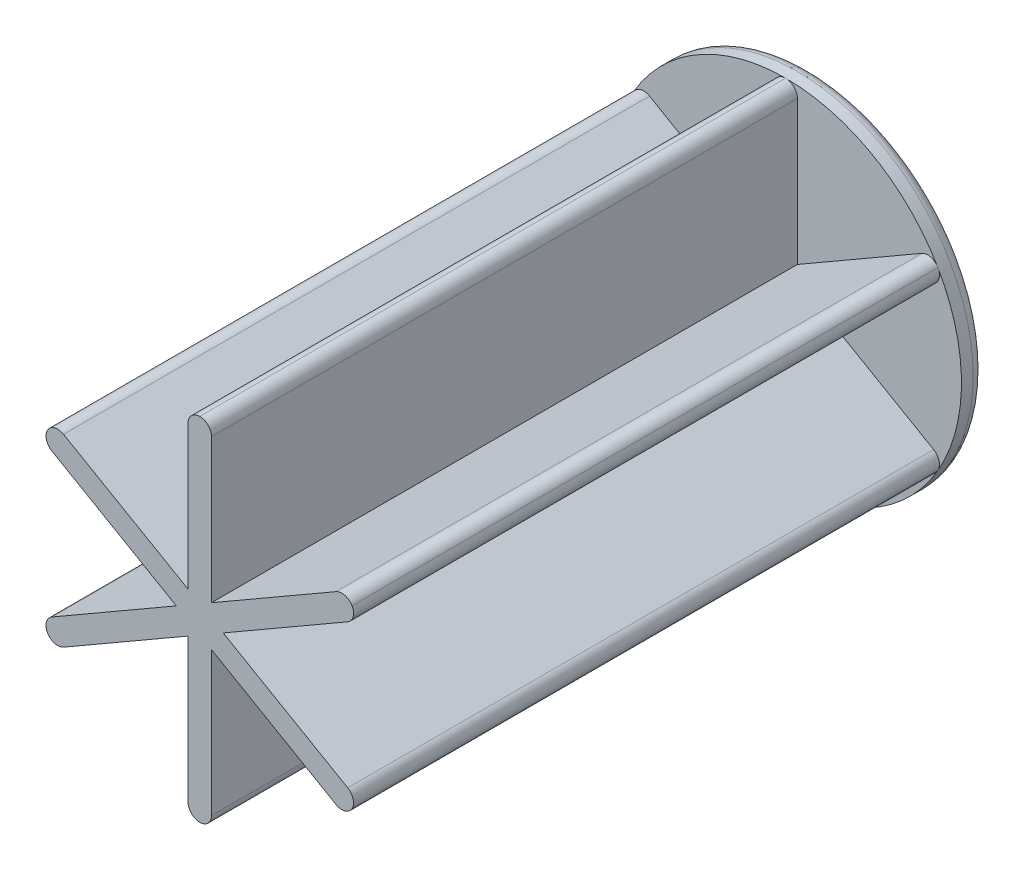
ISO-10303-21;
HEADER;
FILE_DESCRIPTION(('STEP AP214'),'2;1');
FILE_NAME('part.step','',(''),(''),'','','');
FILE_SCHEMA(('AUTOMOTIVE_DESIGN { 1 0 10303 214 1 1 1 1 }'));
ENDSEC;
DATA;
#1=APPLICATION_CONTEXT('core data for automotive mechanical design processes');
#2=APPLICATION_PROTOCOL_DEFINITION('international standard','automotive_design',2000,#1);
#3=PRODUCT_CONTEXT('',#1,'mechanical');
#4=PRODUCT('Part','Part','',(#3));
#5=PRODUCT_RELATED_PRODUCT_CATEGORY('part','',(#4));
#6=PRODUCT_DEFINITION_FORMATION('','',#4);
#7=PRODUCT_DEFINITION_CONTEXT('part definition',#1,'design');
#8=PRODUCT_DEFINITION('design','',#6,#7);
#9=PRODUCT_DEFINITION_SHAPE('','',#8);
#10=(LENGTH_UNIT() NAMED_UNIT(*) SI_UNIT(.MILLI.,.METRE.));
#11=(NAMED_UNIT(*) PLANE_ANGLE_UNIT() SI_UNIT($,.RADIAN.));
#12=(NAMED_UNIT(*) SI_UNIT($,.STERADIAN.) SOLID_ANGLE_UNIT());
#13=UNCERTAINTY_MEASURE_WITH_UNIT(LENGTH_MEASURE(1.E-05),#10,'distance_accuracy_value','');
#14=(GEOMETRIC_REPRESENTATION_CONTEXT(3) GLOBAL_UNCERTAINTY_ASSIGNED_CONTEXT((#13)) GLOBAL_UNIT_ASSIGNED_CONTEXT((#10,
#11,#12)) REPRESENTATION_CONTEXT('',''));
#15=CARTESIAN_POINT('',(0.,0.,0.));
#16=DIRECTION('',(0.,0.,1.));
#17=DIRECTION('',(1.,0.,0.));
#18=AXIS2_PLACEMENT_3D('',#15,#16,#17);
#19=CARTESIAN_POINT('',(0.,0.,2.));
#20=DIRECTION('',(0.,0.,1.));
#21=DIRECTION('',(1.,0.,0.));
#22=AXIS2_PLACEMENT_3D('',#19,#20,#21);
#23=PLANE('',#22);
#24=CARTESIAN_POINT('',(0.,0.,2.));
#25=DIRECTION('',(0.,0.,1.));
#26=DIRECTION('',(1.,0.,0.));
#27=AXIS2_PLACEMENT_3D('',#24,#25,#26);
#28=CIRCLE('',#27,3.);
#29=CARTESIAN_POINT('',(1.,-2.82842712474619,2.));
#30=VERTEX_POINT('',#29);
#31=CARTESIAN_POINT('',(1.94948974278318,-2.28023896615753,2.));
#32=VERTEX_POINT('',#31);
#33=EDGE_CURVE('E331',#30,#32,#28,.T.);
#34=ORIENTED_EDGE('',*,*,#33,.F.);
#35=DIRECTION('',(0.,1.,0.));
#36=VECTOR('',#35,1.);
#37=CARTESIAN_POINT('',(1.,-14.9666295470958,2.));
#38=LINE('',#37,#36);
#39=CARTESIAN_POINT('',(1.,-14.,2.));
#40=VERTEX_POINT('',#39);
#41=EDGE_CURVE('E389',#40,#30,#38,.T.);
#42=ORIENTED_EDGE('',*,*,#41,.F.);
#43=CARTESIAN_POINT('',(0.,-14.,2.));
#44=DIRECTION('',(0.,0.,1.));
#45=DIRECTION('',(1.,0.,0.));
#46=AXIS2_PLACEMENT_3D('',#43,#44,#45);
#47=CIRCLE('',#46,1.);
#48=CARTESIAN_POINT('',(0.,-15.,2.));
#49=VERTEX_POINT('',#48);
#50=EDGE_CURVE('E457',#40,#49,#47,.F.);
#51=ORIENTED_EDGE('',*,*,#50,.T.);
#52=CARTESIAN_POINT('',(0.,0.,2.));
#53=DIRECTION('',(0.,0.,1.));
#54=DIRECTION('',(1.,0.,0.));
#55=AXIS2_PLACEMENT_3D('',#52,#53,#54);
#56=CIRCLE('',#55,15.);
#57=CARTESIAN_POINT('',(12.9903810567666,-7.49999999999997,2.));
#58=VERTEX_POINT('',#57);
#59=EDGE_CURVE('E391',#49,#58,#56,.T.);
#60=ORIENTED_EDGE('',*,*,#59,.T.);
#61=CARTESIAN_POINT('',(12.1243556529822,-6.99999999999997,2.));
#62=DIRECTION('',(0.,0.,1.));
#63=DIRECTION('',(1.,0.,0.));
#64=AXIS2_PLACEMENT_3D('',#61,#62,#63);
#65=CIRCLE('',#64,1.);
#66=CARTESIAN_POINT('',(11.6243556529822,-7.86602540378441,2.));
#67=VERTEX_POINT('',#66);
#68=EDGE_CURVE('E460',#58,#67,#65,.F.);
#69=ORIENTED_EDGE('',*,*,#68,.T.);
#70=DIRECTION('',(0.86602540378444,-0.499999999999998,0.));
#71=VECTOR('',#70,1.);
#72=CARTESIAN_POINT('',(12.4614813968157,-8.34934017733229,2.));
#73=LINE('',#72,#71);
#74=EDGE_CURVE('E354',#32,#67,#73,.T.);
#75=ORIENTED_EDGE('',*,*,#74,.F.);
#76=EDGE_LOOP('',(#34,#42,#51,#60,#69,#75));
#77=FACE_BOUND('',#76,.T.);
#78=ADVANCED_FACE('F37',(#77),#23,.T.);
#79=CARTESIAN_POINT('',(1.,1.73205080756888,2.));
#80=VERTEX_POINT('',#79);
#81=CARTESIAN_POINT('',(1.,14.,2.));
#82=VERTEX_POINT('',#81);
#83=EDGE_CURVE('E388',#80,#82,#38,.T.);
#84=ORIENTED_EDGE('',*,*,#83,.F.);
#85=DIRECTION('',(-0.866025403784436,-0.500000000000004,0.));
#86=VECTOR('',#85,1.);
#87=CARTESIAN_POINT('',(12.4614813968157,8.34934017733238,2.));
#88=LINE('',#87,#86);
#89=CARTESIAN_POINT('',(11.6243556529821,7.86602540378449,2.));
#90=VERTEX_POINT('',#89);
#91=EDGE_CURVE('E347',#90,#80,#88,.T.);
#92=ORIENTED_EDGE('',*,*,#91,.F.);
#93=CARTESIAN_POINT('',(12.1243556529821,7.00000000000006,2.));
#94=DIRECTION('',(0.,0.,1.));
#95=DIRECTION('',(1.,0.,0.));
#96=AXIS2_PLACEMENT_3D('',#93,#94,#95);
#97=CIRCLE('',#96,1.);
#98=CARTESIAN_POINT('',(12.9903810567665,7.50000000000006,2.));
#99=VERTEX_POINT('',#98);
#100=EDGE_CURVE('E467',#90,#99,#97,.F.);
#101=ORIENTED_EDGE('',*,*,#100,.T.);
#102=CARTESIAN_POINT('',(0.,15.,2.));
#103=VERTEX_POINT('',#102);
#104=EDGE_CURVE('E385',#99,#103,#56,.T.);
#105=ORIENTED_EDGE('',*,*,#104,.T.);
#106=CARTESIAN_POINT('',(0.,14.,2.));
#107=DIRECTION('',(0.,0.,1.));
#108=DIRECTION('',(1.,0.,0.));
#109=AXIS2_PLACEMENT_3D('',#106,#107,#108);
#110=CIRCLE('',#109,1.);
#111=EDGE_CURVE('E470',#103,#82,#110,.F.);
#112=ORIENTED_EDGE('',*,*,#111,.T.);
#113=EDGE_LOOP('',(#84,#92,#101,#105,#112));
#114=FACE_BOUND('',#113,.T.);
#115=ADVANCED_FACE('F513',(#114),#23,.T.);
#116=CARTESIAN_POINT('',(0.,0.,2.));
#117=DIRECTION('',(0.,0.,1.));
#118=DIRECTION('',(1.,0.,0.));
#119=AXIS2_PLACEMENT_3D('',#116,#117,#118);
#120=CIRCLE('',#119,3.);
#121=CARTESIAN_POINT('',(2.94948974278318,-0.54818815858865,2.));
#122=VERTEX_POINT('',#121);
#123=CARTESIAN_POINT('',(2.94948974278318,0.548188158588671,2.));
#124=VERTEX_POINT('',#123);
#125=EDGE_CURVE('E323',#122,#124,#120,.T.);
#126=ORIENTED_EDGE('',*,*,#125,.F.);
#127=DIRECTION('',(-0.86602540378444,0.499999999999998,0.));
#128=VECTOR('',#127,1.);
#129=CARTESIAN_POINT('',(13.4614813968157,-6.61728936976341,2.));
#130=LINE('',#129,#128);
#131=CARTESIAN_POINT('',(12.6243556529822,-6.13397459621553,2.));
#132=VERTEX_POINT('',#131);
#133=EDGE_CURVE('E365',#132,#122,#130,.T.);
#134=ORIENTED_EDGE('',*,*,#133,.F.);
#135=CARTESIAN_POINT('',(12.1243556529822,-6.99999999999997,2.));
#136=DIRECTION('',(0.,0.,1.));
#137=DIRECTION('',(1.,0.,0.));
#138=AXIS2_PLACEMENT_3D('',#135,#136,#137);
#139=CIRCLE('',#138,1.);
#140=EDGE_CURVE('E462',#132,#58,#139,.F.);
#141=ORIENTED_EDGE('',*,*,#140,.T.);
#142=EDGE_CURVE('E395',#58,#99,#56,.T.);
#143=ORIENTED_EDGE('',*,*,#142,.T.);
#144=CARTESIAN_POINT('',(12.1243556529821,7.00000000000006,2.));
#145=DIRECTION('',(0.,0.,1.));
#146=DIRECTION('',(1.,0.,0.));
#147=AXIS2_PLACEMENT_3D('',#144,#145,#146);
#148=CIRCLE('',#147,1.);
#149=CARTESIAN_POINT('',(12.6243556529821,6.13397459621562,2.));
#150=VERTEX_POINT('',#149);
#151=EDGE_CURVE('E465',#99,#150,#148,.F.);
#152=ORIENTED_EDGE('',*,*,#151,.T.);
#153=DIRECTION('',(0.866025403784436,0.500000000000004,0.));
#154=VECTOR('',#153,1.);
#155=CARTESIAN_POINT('',(13.4614813968157,6.61728936976351,2.));
#156=LINE('',#155,#154);
#157=EDGE_CURVE('E336',#124,#150,#156,.T.);
#158=ORIENTED_EDGE('',*,*,#157,.F.);
#159=EDGE_LOOP('',(#126,#134,#141,#143,#152,#158));
#160=FACE_BOUND('',#159,.T.);
#161=ADVANCED_FACE('F520',(#160),#23,.T.);
#162=CARTESIAN_POINT('',(-12.9903810567666,7.49999999999997,2.));
#163=VERTEX_POINT('',#162);
#164=EDGE_CURVE('E396',#103,#163,#56,.T.);
#165=ORIENTED_EDGE('',*,*,#164,.T.);
#166=CARTESIAN_POINT('',(-12.1243556529822,6.99999999999997,2.));
#167=DIRECTION('',(0.,0.,1.));
#168=DIRECTION('',(1.,0.,0.));
#169=AXIS2_PLACEMENT_3D('',#166,#167,#168);
#170=CIRCLE('',#169,1.);
#171=CARTESIAN_POINT('',(-11.6243556529821,7.86602540378441,2.));
#172=VERTEX_POINT('',#171);
#173=EDGE_CURVE('E475',#163,#172,#170,.F.);
#174=ORIENTED_EDGE('',*,*,#173,.T.);
#175=CARTESIAN_POINT('',(-1.,1.73205080756886,2.));
#176=VERTEX_POINT('',#175);
#177=EDGE_CURVE('E364',#176,#172,#130,.T.);
#178=ORIENTED_EDGE('',*,*,#177,.F.);
#179=DIRECTION('',(0.,-1.,0.));
#180=VECTOR('',#179,1.);
#181=CARTESIAN_POINT('',(-1.,-14.9666295470958,2.));
#182=LINE('',#181,#180);
#183=CARTESIAN_POINT('',(-1.,14.,2.));
#184=VERTEX_POINT('',#183);
#185=EDGE_CURVE('E386',#184,#176,#182,.T.);
#186=ORIENTED_EDGE('',*,*,#185,.F.);
#187=CARTESIAN_POINT('',(0.,14.,2.));
#188=DIRECTION('',(0.,0.,1.));
#189=DIRECTION('',(1.,0.,0.));
#190=AXIS2_PLACEMENT_3D('',#187,#188,#189);
#191=CIRCLE('',#190,1.);
#192=EDGE_CURVE('E472',#184,#103,#191,.F.);
#193=ORIENTED_EDGE('',*,*,#192,.T.);
#194=EDGE_LOOP('',(#165,#174,#178,#186,#193));
#195=FACE_BOUND('',#194,.T.);
#196=ADVANCED_FACE('F534',(#195),#23,.T.);
#197=CARTESIAN_POINT('',(0.,0.,2.));
#198=DIRECTION('',(0.,0.,1.));
#199=DIRECTION('',(1.,0.,0.));
#200=AXIS2_PLACEMENT_3D('',#197,#198,#199);
#201=CIRCLE('',#200,3.);
#202=CARTESIAN_POINT('',(-1.94948974278317,-2.28023896615754,2.));
#203=VERTEX_POINT('',#202);
#204=CARTESIAN_POINT('',(-1.,-2.82842712474619,2.));
#205=VERTEX_POINT('',#204);
#206=EDGE_CURVE('E315',#203,#205,#201,.T.);
#207=ORIENTED_EDGE('',*,*,#206,.F.);
#208=CARTESIAN_POINT('',(-11.6243556529821,-7.86602540378449,2.));
#209=VERTEX_POINT('',#208);
#210=EDGE_CURVE('E344',#209,#203,#156,.T.);
#211=ORIENTED_EDGE('',*,*,#210,.F.);
#212=CARTESIAN_POINT('',(-12.1243556529821,-7.00000000000006,2.));
#213=DIRECTION('',(0.,0.,1.));
#214=DIRECTION('',(1.,0.,0.));
#215=AXIS2_PLACEMENT_3D('',#212,#213,#214);
#216=CIRCLE('',#215,1.);
#217=CARTESIAN_POINT('',(-12.9903810567665,-7.50000000000006,2.));
#218=VERTEX_POINT('',#217);
#219=EDGE_CURVE('E60',#209,#218,#216,.F.);
#220=ORIENTED_EDGE('',*,*,#219,.T.);
#221=EDGE_CURVE('E394',#218,#49,#56,.T.);
#222=ORIENTED_EDGE('',*,*,#221,.T.);
#223=CARTESIAN_POINT('',(0.,-14.,2.));
#224=DIRECTION('',(0.,0.,1.));
#225=DIRECTION('',(1.,0.,0.));
#226=AXIS2_PLACEMENT_3D('',#223,#224,#225);
#227=CIRCLE('',#226,1.);
#228=CARTESIAN_POINT('',(-1.,-14.,2.));
#229=VERTEX_POINT('',#228);
#230=EDGE_CURVE('E455',#49,#229,#227,.F.);
#231=ORIENTED_EDGE('',*,*,#230,.T.);
#232=EDGE_CURVE('E378',#205,#229,#182,.T.);
#233=ORIENTED_EDGE('',*,*,#232,.F.);
#234=EDGE_LOOP('',(#207,#211,#220,#222,#231,#233));
#235=FACE_BOUND('',#234,.T.);
#236=ADVANCED_FACE('F527',(#235),#23,.T.);
#237=CARTESIAN_POINT('',(0.,0.,2.));
#238=DIRECTION('',(0.,0.,1.));
#239=DIRECTION('',(1.,0.,0.));
#240=AXIS2_PLACEMENT_3D('',#237,#238,#239);
#241=CIRCLE('',#240,3.);
#242=CARTESIAN_POINT('',(-2.94948974278318,0.548188158588649,2.));
#243=VERTEX_POINT('',#242);
#244=CARTESIAN_POINT('',(-2.94948974278318,-0.548188158588668,2.));
#245=VERTEX_POINT('',#244);
#246=EDGE_CURVE('E308',#243,#245,#241,.T.);
#247=ORIENTED_EDGE('',*,*,#246,.F.);
#248=CARTESIAN_POINT('',(-12.6243556529821,6.13397459621553,2.));
#249=VERTEX_POINT('',#248);
#250=EDGE_CURVE('E362',#249,#243,#73,.T.);
#251=ORIENTED_EDGE('',*,*,#250,.F.);
#252=CARTESIAN_POINT('',(-12.1243556529822,6.99999999999997,2.));
#253=DIRECTION('',(0.,0.,1.));
#254=DIRECTION('',(1.,0.,0.));
#255=AXIS2_PLACEMENT_3D('',#252,#253,#254);
#256=CIRCLE('',#255,1.);
#257=EDGE_CURVE('E477',#249,#163,#256,.F.);
#258=ORIENTED_EDGE('',*,*,#257,.T.);
#259=EDGE_CURVE('E556',#163,#218,#56,.T.);
#260=ORIENTED_EDGE('',*,*,#259,.T.);
#261=CARTESIAN_POINT('',(-12.1243556529821,-7.00000000000006,2.));
#262=DIRECTION('',(0.,0.,1.));
#263=DIRECTION('',(1.,0.,0.));
#264=AXIS2_PLACEMENT_3D('',#261,#262,#263);
#265=CIRCLE('',#264,1.);
#266=CARTESIAN_POINT('',(-12.6243556529821,-6.13397459621562,2.));
#267=VERTEX_POINT('',#266);
#268=EDGE_CURVE('E52',#218,#267,#265,.F.);
#269=ORIENTED_EDGE('',*,*,#268,.T.);
#270=EDGE_CURVE('E346',#245,#267,#88,.T.);
#271=ORIENTED_EDGE('',*,*,#270,.F.);
#272=EDGE_LOOP('',(#247,#251,#258,#260,#269,#271));
#273=FACE_BOUND('',#272,.T.);
#274=ADVANCED_FACE('F516',(#273),#23,.T.);
#275=CARTESIAN_POINT('',(-1.,-14.9666295470958,52.));
#276=DIRECTION('',(1.,0.,0.));
#277=DIRECTION('',(0.,0.,-1.));
#278=AXIS2_PLACEMENT_3D('',#275,#276,#277);
#279=PLANE('',#278);
#280=DIRECTION('',(0.,-1.,0.));
#281=VECTOR('',#280,1.);
#282=CARTESIAN_POINT('',(-1.,-14.9666295470958,52.));
#283=LINE('',#282,#281);
#284=CARTESIAN_POINT('',(-1.,14.,52.));
#285=VERTEX_POINT('',#284);
#286=CARTESIAN_POINT('',(-0.999999999999999,1.73205080756887,52.));
#287=VERTEX_POINT('',#286);
#288=EDGE_CURVE('E379',#285,#287,#283,.T.);
#289=ORIENTED_EDGE('',*,*,#288,.F.);
#290=DIRECTION('',(0.,0.,-1.));
#291=VECTOR('',#290,1.);
#292=CARTESIAN_POINT('',(-1.,14.,52.));
#293=LINE('',#292,#291);
#294=EDGE_CURVE('E444',#285,#184,#293,.T.);
#295=ORIENTED_EDGE('',*,*,#294,.T.);
#296=ORIENTED_EDGE('',*,*,#185,.T.);
#297=DIRECTION('',(0.,0.,-1.));
#298=VECTOR('',#297,1.);
#299=CARTESIAN_POINT('',(-1.,1.73205080756887,52.));
#300=LINE('',#299,#298);
#301=EDGE_CURVE('E372',#287,#176,#300,.T.);
#302=ORIENTED_EDGE('',*,*,#301,.F.);
#303=EDGE_LOOP('',(#289,#295,#296,#302));
#304=FACE_BOUND('',#303,.T.);
#305=ADVANCED_FACE('F526',(#304),#279,.F.);
#306=ORIENTED_EDGE('',*,*,#232,.T.);
#307=DIRECTION('',(0.,0.,-1.));
#308=VECTOR('',#307,1.);
#309=CARTESIAN_POINT('',(-1.,-14.,52.));
#310=LINE('',#309,#308);
#311=CARTESIAN_POINT('',(-1.,-14.,52.));
#312=VERTEX_POINT('',#311);
#313=EDGE_CURVE('E402',#229,#312,#310,.F.);
#314=ORIENTED_EDGE('',*,*,#313,.T.);
#315=CARTESIAN_POINT('',(-1.,-1.73205080756889,52.));
#316=VERTEX_POINT('',#315);
#317=EDGE_CURVE('E382',#316,#312,#283,.T.);
#318=ORIENTED_EDGE('',*,*,#317,.F.);
#319=DIRECTION('',(0.,0.,1.));
#320=VECTOR('',#319,1.);
#321=CARTESIAN_POINT('',(-1.,-1.73205080756888,52.));
#322=LINE('',#321,#320);
#323=CARTESIAN_POINT('',(-1.,-1.73205080756888,10.));
#324=VERTEX_POINT('',#323);
#325=EDGE_CURVE('E361',#324,#316,#322,.T.);
#326=ORIENTED_EDGE('',*,*,#325,.F.);
#327=DIRECTION('',(0.,1.,0.));
#328=VECTOR('',#327,1.);
#329=CARTESIAN_POINT('',(-1.,-14.9666295470958,10.));
#330=LINE('',#329,#328);
#331=CARTESIAN_POINT('',(-1.,-2.82842712474619,10.));
#332=VERTEX_POINT('',#331);
#333=EDGE_CURVE('E298',#332,#324,#330,.T.);
#334=ORIENTED_EDGE('',*,*,#333,.F.);
#335=DIRECTION('',(0.,0.,-1.));
#336=VECTOR('',#335,1.);
#337=CARTESIAN_POINT('',(-1.,-2.82842712474619,10.));
#338=LINE('',#337,#336);
#339=EDGE_CURVE('E317',#332,#205,#338,.T.);
#340=ORIENTED_EDGE('',*,*,#339,.T.);
#341=EDGE_LOOP('',(#306,#314,#318,#326,#334,#340));
#342=FACE_BOUND('',#341,.T.);
#343=ADVANCED_FACE('F532',(#342),#279,.F.);
#344=CARTESIAN_POINT('',(1.,-14.9666295470958,52.));
#345=DIRECTION('',(-1.,0.,0.));
#346=DIRECTION('',(0.,0.,1.));
#347=AXIS2_PLACEMENT_3D('',#344,#345,#346);
#348=PLANE('',#347);
#349=DIRECTION('',(0.,1.,0.));
#350=VECTOR('',#349,1.);
#351=CARTESIAN_POINT('',(1.,-14.9666295470958,52.));
#352=LINE('',#351,#350);
#353=CARTESIAN_POINT('',(1.,-14.,52.));
#354=VERTEX_POINT('',#353);
#355=CARTESIAN_POINT('',(1.,-1.73205080756888,52.));
#356=VERTEX_POINT('',#355);
#357=EDGE_CURVE('E383',#354,#356,#352,.T.);
#358=ORIENTED_EDGE('',*,*,#357,.F.);
#359=DIRECTION('',(0.,0.,-1.));
#360=VECTOR('',#359,1.);
#361=CARTESIAN_POINT('',(1.,-14.,52.));
#362=LINE('',#361,#360);
#363=EDGE_CURVE('E429',#354,#40,#362,.T.);
#364=ORIENTED_EDGE('',*,*,#363,.T.);
#365=ORIENTED_EDGE('',*,*,#41,.T.);
#366=DIRECTION('',(0.,0.,-1.));
#367=VECTOR('',#366,1.);
#368=CARTESIAN_POINT('',(1.,-2.82842712474619,10.));
#369=LINE('',#368,#367);
#370=CARTESIAN_POINT('',(1.,-2.82842712474619,10.));
#371=VERTEX_POINT('',#370);
#372=EDGE_CURVE('E333',#30,#371,#369,.F.);
#373=ORIENTED_EDGE('',*,*,#372,.T.);
#374=DIRECTION('',(0.,-1.,0.));
#375=VECTOR('',#374,1.);
#376=CARTESIAN_POINT('',(1.,-14.9666295470958,10.));
#377=LINE('',#376,#375);
#378=CARTESIAN_POINT('',(0.999999999999999,-1.73205080756887,10.));
#379=VERTEX_POINT('',#378);
#380=EDGE_CURVE('E306',#379,#371,#377,.T.);
#381=ORIENTED_EDGE('',*,*,#380,.F.);
#382=DIRECTION('',(0.,0.,-1.));
#383=VECTOR('',#382,1.);
#384=CARTESIAN_POINT('',(1.,-1.73205080756887,52.));
#385=LINE('',#384,#383);
#386=EDGE_CURVE('E375',#356,#379,#385,.T.);
#387=ORIENTED_EDGE('',*,*,#386,.F.);
#388=EDGE_LOOP('',(#358,#364,#365,#373,#381,#387));
#389=FACE_BOUND('',#388,.T.);
#390=ADVANCED_FACE('F610',(#389),#348,.F.);
#391=ORIENTED_EDGE('',*,*,#83,.T.);
#392=DIRECTION('',(0.,0.,-1.));
#393=VECTOR('',#392,1.);
#394=CARTESIAN_POINT('',(1.,14.,52.));
#395=LINE('',#394,#393);
#396=CARTESIAN_POINT('',(1.,14.,52.));
#397=VERTEX_POINT('',#396);
#398=EDGE_CURVE('E441',#82,#397,#395,.F.);
#399=ORIENTED_EDGE('',*,*,#398,.T.);
#400=CARTESIAN_POINT('',(1.,1.73205080756889,52.));
#401=VERTEX_POINT('',#400);
#402=EDGE_CURVE('E381',#401,#397,#352,.T.);
#403=ORIENTED_EDGE('',*,*,#402,.F.);
#404=DIRECTION('',(0.,0.,1.));
#405=VECTOR('',#404,1.);
#406=CARTESIAN_POINT('',(1.,1.73205080756889,52.));
#407=LINE('',#406,#405);
#408=EDGE_CURVE('E369',#80,#401,#407,.T.);
#409=ORIENTED_EDGE('',*,*,#408,.F.);
#410=EDGE_LOOP('',(#391,#399,#403,#409));
#411=FACE_BOUND('',#410,.T.);
#412=ADVANCED_FACE('F657',(#411),#348,.F.);
#413=CARTESIAN_POINT('',(0.,0.,2.));
#414=DIRECTION('',(0.,0.,-1.));
#415=DIRECTION('',(-1.,0.,0.));
#416=AXIS2_PLACEMENT_3D('',#413,#414,#415);
#417=CYLINDRICAL_SURFACE('',#416,15.);
#418=CARTESIAN_POINT('',(0.,0.,1.));
#419=DIRECTION('',(0.,0.,1.));
#420=DIRECTION('',(1.,0.,0.));
#421=AXIS2_PLACEMENT_3D('',#418,#419,#420);
#422=CIRCLE('',#421,15.);
#423=CARTESIAN_POINT('',(15.,0.,1.));
#424=VERTEX_POINT('',#423);
#425=EDGE_CURVE('E45',#424,#424,#422,.T.);
#426=ORIENTED_EDGE('',*,*,#425,.T.);
#427=EDGE_LOOP('',(#426));
#428=FACE_BOUND('',#427,.T.);
#429=ORIENTED_EDGE('',*,*,#59,.F.);
#430=ORIENTED_EDGE('',*,*,#221,.F.);
#431=ORIENTED_EDGE('',*,*,#259,.F.);
#432=ORIENTED_EDGE('',*,*,#164,.F.);
#433=ORIENTED_EDGE('',*,*,#104,.F.);
#434=ORIENTED_EDGE('',*,*,#142,.F.);
#435=EDGE_LOOP('',(#429,#430,#431,#432,#433,#434));
#436=FACE_BOUND('',#435,.T.);
#437=ADVANCED_FACE('F500',(#428,#436),#417,.T.);
#438=CARTESIAN_POINT('',(0.,0.,0.));
#439=DIRECTION('',(0.,0.,1.));
#440=DIRECTION('',(1.,0.,0.));
#441=AXIS2_PLACEMENT_3D('',#438,#439,#440);
#442=PLANE('',#441);
#443=CARTESIAN_POINT('',(0.,0.,0.));
#444=DIRECTION('',(0.,0.,1.));
#445=DIRECTION('',(1.,0.,0.));
#446=AXIS2_PLACEMENT_3D('',#443,#444,#445);
#447=CIRCLE('',#446,14.);
#448=CARTESIAN_POINT('',(14.,0.,0.));
#449=VERTEX_POINT('',#448);
#450=EDGE_CURVE('E11',#449,#449,#447,.F.);
#451=ORIENTED_EDGE('',*,*,#450,.T.);
#452=EDGE_LOOP('',(#451));
#453=FACE_BOUND('',#452,.T.);
#454=DIRECTION('',(1.,0.,0.));
#455=VECTOR('',#454,1.);
#456=CARTESIAN_POINT('',(2.59807621135332,1.5,0.));
#457=LINE('',#456,#455);
#458=CARTESIAN_POINT('',(-2.59807621135332,1.5,0.));
#459=VERTEX_POINT('',#458);
#460=CARTESIAN_POINT('',(2.59807621135332,1.5,0.));
#461=VERTEX_POINT('',#460);
#462=EDGE_CURVE('E273',#459,#461,#457,.T.);
#463=ORIENTED_EDGE('',*,*,#462,.F.);
#464=CARTESIAN_POINT('',(0.,0.,0.));
#465=DIRECTION('',(0.,0.,-1.));
#466=DIRECTION('',(-1.,0.,0.));
#467=AXIS2_PLACEMENT_3D('',#464,#465,#466);
#468=CIRCLE('',#467,3.);
#469=EDGE_CURVE('E280',#461,#459,#468,.T.);
#470=ORIENTED_EDGE('',*,*,#469,.F.);
#471=EDGE_LOOP('',(#463,#470));
#472=FACE_BOUND('',#471,.T.);
#473=ADVANCED_FACE('F704',(#453,#472),#442,.F.);
#474=CARTESIAN_POINT('',(0.,0.,52.));
#475=DIRECTION('',(0.,0.,1.));
#476=DIRECTION('',(1.,0.,0.));
#477=AXIS2_PLACEMENT_3D('',#474,#475,#476);
#478=PLANE('',#477);
#479=ORIENTED_EDGE('',*,*,#317,.T.);
#480=CARTESIAN_POINT('',(0.,-14.,52.));
#481=DIRECTION('',(0.,0.,1.));
#482=DIRECTION('',(1.,0.,0.));
#483=AXIS2_PLACEMENT_3D('',#480,#481,#482);
#484=CIRCLE('',#483,1.);
#485=CARTESIAN_POINT('',(0.,-15.,52.));
#486=VERTEX_POINT('',#485);
#487=EDGE_CURVE('E427',#312,#486,#484,.T.);
#488=ORIENTED_EDGE('',*,*,#487,.T.);
#489=CARTESIAN_POINT('',(0.,-14.,52.));
#490=DIRECTION('',(0.,0.,1.));
#491=DIRECTION('',(1.,0.,0.));
#492=AXIS2_PLACEMENT_3D('',#489,#490,#491);
#493=CIRCLE('',#492,1.);
#494=EDGE_CURVE('E425',#486,#354,#493,.T.);
#495=ORIENTED_EDGE('',*,*,#494,.T.);
#496=ORIENTED_EDGE('',*,*,#357,.T.);
#497=DIRECTION('',(0.86602540378444,-0.499999999999998,0.));
#498=VECTOR('',#497,1.);
#499=CARTESIAN_POINT('',(12.4614813968157,-8.34934017733229,52.));
#500=LINE('',#499,#498);
#501=CARTESIAN_POINT('',(11.6243556529822,-7.86602540378441,52.));
#502=VERTEX_POINT('',#501);
#503=EDGE_CURVE('E358',#356,#502,#500,.T.);
#504=ORIENTED_EDGE('',*,*,#503,.T.);
#505=CARTESIAN_POINT('',(12.1243556529822,-6.99999999999997,52.));
#506=DIRECTION('',(0.,0.,1.));
#507=DIRECTION('',(1.,0.,0.));
#508=AXIS2_PLACEMENT_3D('',#505,#506,#507);
#509=CIRCLE('',#508,1.);
#510=CARTESIAN_POINT('',(12.9903810567666,-7.49999999999997,52.));
#511=VERTEX_POINT('',#510);
#512=EDGE_CURVE('E423',#502,#511,#509,.T.);
#513=ORIENTED_EDGE('',*,*,#512,.T.);
#514=CARTESIAN_POINT('',(12.1243556529822,-6.99999999999997,52.));
#515=DIRECTION('',(0.,0.,1.));
#516=DIRECTION('',(1.,0.,0.));
#517=AXIS2_PLACEMENT_3D('',#514,#515,#516);
#518=CIRCLE('',#517,1.);
#519=CARTESIAN_POINT('',(12.6243556529822,-6.13397459621553,52.));
#520=VERTEX_POINT('',#519);
#521=EDGE_CURVE('E421',#511,#520,#518,.T.);
#522=ORIENTED_EDGE('',*,*,#521,.T.);
#523=DIRECTION('',(-0.86602540378444,0.499999999999998,0.));
#524=VECTOR('',#523,1.);
#525=CARTESIAN_POINT('',(13.4614813968157,-6.61728936976341,52.));
#526=LINE('',#525,#524);
#527=CARTESIAN_POINT('',(2.,0.,52.));
#528=VERTEX_POINT('',#527);
#529=EDGE_CURVE('E359',#520,#528,#526,.T.);
#530=ORIENTED_EDGE('',*,*,#529,.T.);
#531=DIRECTION('',(0.866025403784436,0.500000000000004,0.));
#532=VECTOR('',#531,1.);
#533=CARTESIAN_POINT('',(13.4614813968157,6.61728936976351,52.));
#534=LINE('',#533,#532);
#535=CARTESIAN_POINT('',(12.6243556529821,6.13397459621562,52.));
#536=VERTEX_POINT('',#535);
#537=EDGE_CURVE('E340',#528,#536,#534,.T.);
#538=ORIENTED_EDGE('',*,*,#537,.T.);
#539=CARTESIAN_POINT('',(12.1243556529821,7.00000000000006,52.));
#540=DIRECTION('',(0.,0.,1.));
#541=DIRECTION('',(1.,0.,0.));
#542=AXIS2_PLACEMENT_3D('',#539,#540,#541);
#543=CIRCLE('',#542,1.);
#544=CARTESIAN_POINT('',(12.9903810567665,7.50000000000006,52.));
#545=VERTEX_POINT('',#544);
#546=EDGE_CURVE('E419',#536,#545,#543,.T.);
#547=ORIENTED_EDGE('',*,*,#546,.T.);
#548=CARTESIAN_POINT('',(12.1243556529821,7.00000000000006,52.));
#549=DIRECTION('',(0.,0.,1.));
#550=DIRECTION('',(1.,0.,0.));
#551=AXIS2_PLACEMENT_3D('',#548,#549,#550);
#552=CIRCLE('',#551,1.);
#553=CARTESIAN_POINT('',(11.6243556529821,7.86602540378449,52.));
#554=VERTEX_POINT('',#553);
#555=EDGE_CURVE('E417',#545,#554,#552,.T.);
#556=ORIENTED_EDGE('',*,*,#555,.T.);
#557=DIRECTION('',(-0.866025403784436,-0.500000000000004,0.));
#558=VECTOR('',#557,1.);
#559=CARTESIAN_POINT('',(12.4614813968157,8.34934017733238,52.));
#560=LINE('',#559,#558);
#561=EDGE_CURVE('E341',#554,#401,#560,.T.);
#562=ORIENTED_EDGE('',*,*,#561,.T.);
#563=ORIENTED_EDGE('',*,*,#402,.T.);
#564=CARTESIAN_POINT('',(0.,14.,52.));
#565=DIRECTION('',(0.,0.,1.));
#566=DIRECTION('',(1.,0.,0.));
#567=AXIS2_PLACEMENT_3D('',#564,#565,#566);
#568=CIRCLE('',#567,1.);
#569=CARTESIAN_POINT('',(0.,15.,52.));
#570=VERTEX_POINT('',#569);
#571=EDGE_CURVE('E415',#397,#570,#568,.T.);
#572=ORIENTED_EDGE('',*,*,#571,.T.);
#573=CARTESIAN_POINT('',(0.,14.,52.));
#574=DIRECTION('',(0.,0.,1.));
#575=DIRECTION('',(1.,0.,0.));
#576=AXIS2_PLACEMENT_3D('',#573,#574,#575);
#577=CIRCLE('',#576,1.);
#578=EDGE_CURVE('E413',#570,#285,#577,.T.);
#579=ORIENTED_EDGE('',*,*,#578,.T.);
#580=ORIENTED_EDGE('',*,*,#288,.T.);
#581=CARTESIAN_POINT('',(-11.6243556529821,7.86602540378441,52.));
#582=VERTEX_POINT('',#581);
#583=EDGE_CURVE('E357',#287,#582,#526,.T.);
#584=ORIENTED_EDGE('',*,*,#583,.T.);
#585=CARTESIAN_POINT('',(-12.1243556529822,6.99999999999997,52.));
#586=DIRECTION('',(0.,0.,1.));
#587=DIRECTION('',(1.,0.,0.));
#588=AXIS2_PLACEMENT_3D('',#585,#586,#587);
#589=CIRCLE('',#588,1.);
#590=CARTESIAN_POINT('',(-12.9903810567666,7.49999999999997,52.));
#591=VERTEX_POINT('',#590);
#592=EDGE_CURVE('E411',#582,#591,#589,.T.);
#593=ORIENTED_EDGE('',*,*,#592,.T.);
#594=CARTESIAN_POINT('',(-12.1243556529822,6.99999999999997,52.));
#595=DIRECTION('',(0.,0.,1.));
#596=DIRECTION('',(1.,0.,0.));
#597=AXIS2_PLACEMENT_3D('',#594,#595,#596);
#598=CIRCLE('',#597,1.);
#599=CARTESIAN_POINT('',(-12.6243556529821,6.13397459621553,52.));
#600=VERTEX_POINT('',#599);
#601=EDGE_CURVE('E409',#591,#600,#598,.T.);
#602=ORIENTED_EDGE('',*,*,#601,.T.);
#603=CARTESIAN_POINT('',(-2.,0.,52.));
#604=VERTEX_POINT('',#603);
#605=EDGE_CURVE('E355',#600,#604,#500,.T.);
#606=ORIENTED_EDGE('',*,*,#605,.T.);
#607=CARTESIAN_POINT('',(-12.6243556529821,-6.13397459621562,52.));
#608=VERTEX_POINT('',#607);
#609=EDGE_CURVE('E339',#604,#608,#560,.T.);
#610=ORIENTED_EDGE('',*,*,#609,.T.);
#611=CARTESIAN_POINT('',(-12.1243556529821,-7.00000000000006,52.));
#612=DIRECTION('',(0.,0.,1.));
#613=DIRECTION('',(1.,0.,0.));
#614=AXIS2_PLACEMENT_3D('',#611,#612,#613);
#615=CIRCLE('',#614,1.);
#616=CARTESIAN_POINT('',(-12.9903810567665,-7.50000000000006,52.));
#617=VERTEX_POINT('',#616);
#618=EDGE_CURVE('E405',#608,#617,#615,.T.);
#619=ORIENTED_EDGE('',*,*,#618,.T.);
#620=CARTESIAN_POINT('',(-12.1243556529821,-7.00000000000006,52.));
#621=DIRECTION('',(0.,0.,1.));
#622=DIRECTION('',(1.,0.,0.));
#623=AXIS2_PLACEMENT_3D('',#620,#621,#622);
#624=CIRCLE('',#623,1.);
#625=CARTESIAN_POINT('',(-11.6243556529821,-7.86602540378449,52.));
#626=VERTEX_POINT('',#625);
#627=EDGE_CURVE('E407',#617,#626,#624,.T.);
#628=ORIENTED_EDGE('',*,*,#627,.T.);
#629=EDGE_CURVE('E337',#626,#316,#534,.T.);
#630=ORIENTED_EDGE('',*,*,#629,.T.);
#631=EDGE_LOOP('',(#479,#488,#495,#496,#504,#513,#522,#530,#538,#547,#556,#562,#563,#572,#579,
#580,#584,#593,#602,#606,#610,#619,#628,#630));
#632=FACE_BOUND('',#631,.T.);
#633=ADVANCED_FACE('F569',(#632),#478,.T.);
#634=CARTESIAN_POINT('',(12.4614813968157,8.34934017733238,52.));
#635=DIRECTION('',(0.500000000000004,-0.866025403784436,0.));
#636=DIRECTION('',(0.866025403784436,0.500000000000004,0.));
#637=AXIS2_PLACEMENT_3D('',#634,#635,#636);
#638=PLANE('',#637);
#639=ORIENTED_EDGE('',*,*,#561,.F.);
#640=DIRECTION('',(0.,0.,-1.));
#641=VECTOR('',#640,1.);
#642=CARTESIAN_POINT('',(11.6243556529821,7.86602540378449,52.));
#643=LINE('',#642,#641);
#644=EDGE_CURVE('E439',#554,#90,#643,.T.);
#645=ORIENTED_EDGE('',*,*,#644,.T.);
#646=ORIENTED_EDGE('',*,*,#91,.T.);
#647=ORIENTED_EDGE('',*,*,#408,.T.);
#648=EDGE_LOOP('',(#639,#645,#646,#647));
#649=FACE_BOUND('',#648,.T.);
#650=ADVANCED_FACE('F654',(#649),#638,.F.);
#651=CARTESIAN_POINT('',(12.4614813968157,-8.34934017733229,52.));
#652=DIRECTION('',(0.499999999999998,0.86602540378444,0.));
#653=DIRECTION('',(-0.86602540378444,0.499999999999998,0.));
#654=AXIS2_PLACEMENT_3D('',#651,#652,#653);
#655=PLANE('',#654);
#656=ORIENTED_EDGE('',*,*,#74,.T.);
#657=DIRECTION('',(0.,0.,-1.));
#658=VECTOR('',#657,1.);
#659=CARTESIAN_POINT('',(11.6243556529822,-7.86602540378441,52.));
#660=LINE('',#659,#658);
#661=EDGE_CURVE('E431',#67,#502,#660,.F.);
#662=ORIENTED_EDGE('',*,*,#661,.T.);
#663=ORIENTED_EDGE('',*,*,#503,.F.);
#664=ORIENTED_EDGE('',*,*,#386,.T.);
#665=DIRECTION('',(-0.86602540378444,0.499999999999998,0.));
#666=VECTOR('',#665,1.);
#667=CARTESIAN_POINT('',(12.4614813968157,-8.34934017733229,10.));
#668=LINE('',#667,#666);
#669=CARTESIAN_POINT('',(1.94948974278318,-2.28023896615753,10.));
#670=VERTEX_POINT('',#669);
#671=EDGE_CURVE('E304',#670,#379,#668,.T.);
#672=ORIENTED_EDGE('',*,*,#671,.F.);
#673=DIRECTION('',(0.,0.,-1.));
#674=VECTOR('',#673,1.);
#675=CARTESIAN_POINT('',(1.94948974278318,-2.28023896615753,10.));
#676=LINE('',#675,#674);
#677=EDGE_CURVE('E328',#670,#32,#676,.T.);
#678=ORIENTED_EDGE('',*,*,#677,.T.);
#679=EDGE_LOOP('',(#656,#662,#663,#664,#672,#678));
#680=FACE_BOUND('',#679,.T.);
#681=ADVANCED_FACE('F605',(#680),#655,.F.);
#682=CARTESIAN_POINT('',(13.4614813968157,6.61728936976351,52.));
#683=DIRECTION('',(-0.500000000000004,0.866025403784436,0.));
#684=DIRECTION('',(-0.866025403784436,-0.500000000000004,0.));
#685=AXIS2_PLACEMENT_3D('',#682,#683,#684);
#686=PLANE('',#685);
#687=ORIENTED_EDGE('',*,*,#157,.T.);
#688=DIRECTION('',(0.,0.,-1.));
#689=VECTOR('',#688,1.);
#690=CARTESIAN_POINT('',(12.6243556529821,6.13397459621562,52.));
#691=LINE('',#690,#689);
#692=EDGE_CURVE('E436',#150,#536,#691,.F.);
#693=ORIENTED_EDGE('',*,*,#692,.T.);
#694=ORIENTED_EDGE('',*,*,#537,.F.);
#695=DIRECTION('',(0.,0.,-1.));
#696=VECTOR('',#695,1.);
#697=CARTESIAN_POINT('',(1.99999999999999,0.,52.));
#698=LINE('',#697,#696);
#699=CARTESIAN_POINT('',(1.99999999999999,0.,10.));
#700=VERTEX_POINT('',#699);
#701=EDGE_CURVE('E351',#528,#700,#698,.T.);
#702=ORIENTED_EDGE('',*,*,#701,.T.);
#703=DIRECTION('',(-0.866025403784436,-0.500000000000004,0.));
#704=VECTOR('',#703,1.);
#705=CARTESIAN_POINT('',(13.4614813968157,6.61728936976351,10.));
#706=LINE('',#705,#704);
#707=CARTESIAN_POINT('',(2.94948974278318,0.548188158588671,10.));
#708=VERTEX_POINT('',#707);
#709=EDGE_CURVE('E302',#708,#700,#706,.T.);
#710=ORIENTED_EDGE('',*,*,#709,.F.);
#711=DIRECTION('',(0.,0.,-1.));
#712=VECTOR('',#711,1.);
#713=CARTESIAN_POINT('',(2.94948974278318,0.548188158588671,10.));
#714=LINE('',#713,#712);
#715=EDGE_CURVE('E325',#708,#124,#714,.T.);
#716=ORIENTED_EDGE('',*,*,#715,.T.);
#717=EDGE_LOOP('',(#687,#693,#694,#702,#710,#716));
#718=FACE_BOUND('',#717,.T.);
#719=ADVANCED_FACE('F634',(#718),#686,.F.);
#720=CARTESIAN_POINT('',(13.4614813968157,-6.61728936976341,52.));
#721=DIRECTION('',(-0.499999999999998,-0.86602540378444,0.));
#722=DIRECTION('',(0.86602540378444,-0.499999999999998,0.));
#723=AXIS2_PLACEMENT_3D('',#720,#721,#722);
#724=PLANE('',#723);
#725=ORIENTED_EDGE('',*,*,#529,.F.);
#726=DIRECTION('',(0.,0.,-1.));
#727=VECTOR('',#726,1.);
#728=CARTESIAN_POINT('',(12.6243556529822,-6.13397459621553,52.));
#729=LINE('',#728,#727);
#730=EDGE_CURVE('E434',#520,#132,#729,.T.);
#731=ORIENTED_EDGE('',*,*,#730,.T.);
#732=ORIENTED_EDGE('',*,*,#133,.T.);
#733=DIRECTION('',(0.,0.,-1.));
#734=VECTOR('',#733,1.);
#735=CARTESIAN_POINT('',(2.94948974278318,-0.54818815858865,10.));
#736=LINE('',#735,#734);
#737=CARTESIAN_POINT('',(2.94948974278318,-0.54818815858865,10.));
#738=VERTEX_POINT('',#737);
#739=EDGE_CURVE('E320',#122,#738,#736,.F.);
#740=ORIENTED_EDGE('',*,*,#739,.T.);
#741=DIRECTION('',(0.86602540378444,-0.499999999999998,0.));
#742=VECTOR('',#741,1.);
#743=CARTESIAN_POINT('',(13.4614813968157,-6.61728936976341,10.));
#744=LINE('',#743,#742);
#745=EDGE_CURVE('E300',#700,#738,#744,.T.);
#746=ORIENTED_EDGE('',*,*,#745,.F.);
#747=ORIENTED_EDGE('',*,*,#701,.F.);
#748=EDGE_LOOP('',(#725,#731,#732,#740,#746,#747));
#749=FACE_BOUND('',#748,.T.);
#750=ADVANCED_FACE('F625',(#749),#724,.F.);
#751=ORIENTED_EDGE('',*,*,#177,.T.);
#752=DIRECTION('',(0.,0.,-1.));
#753=VECTOR('',#752,1.);
#754=CARTESIAN_POINT('',(-11.6243556529822,7.86602540378441,52.));
#755=LINE('',#754,#753);
#756=EDGE_CURVE('E446',#172,#582,#755,.F.);
#757=ORIENTED_EDGE('',*,*,#756,.T.);
#758=ORIENTED_EDGE('',*,*,#583,.F.);
#759=ORIENTED_EDGE('',*,*,#301,.T.);
#760=EDGE_LOOP('',(#751,#757,#758,#759));
#761=FACE_BOUND('',#760,.T.);
#762=ADVANCED_FACE('F846',(#761),#724,.F.);
#763=ORIENTED_EDGE('',*,*,#629,.F.);
#764=DIRECTION('',(0.,0.,-1.));
#765=VECTOR('',#764,1.);
#766=CARTESIAN_POINT('',(-11.6243556529821,-7.86602540378449,52.));
#767=LINE('',#766,#765);
#768=EDGE_CURVE('E451',#626,#209,#767,.T.);
#769=ORIENTED_EDGE('',*,*,#768,.T.);
#770=ORIENTED_EDGE('',*,*,#210,.T.);
#771=DIRECTION('',(0.,0.,-1.));
#772=VECTOR('',#771,1.);
#773=CARTESIAN_POINT('',(-1.94948974278317,-2.28023896615754,10.));
#774=LINE('',#773,#772);
#775=CARTESIAN_POINT('',(-1.94948974278317,-2.28023896615754,10.));
#776=VERTEX_POINT('',#775);
#777=EDGE_CURVE('E312',#203,#776,#774,.F.);
#778=ORIENTED_EDGE('',*,*,#777,.T.);
#779=DIRECTION('',(-0.866025403784436,-0.500000000000004,0.));
#780=VECTOR('',#779,1.);
#781=CARTESIAN_POINT('',(13.4614813968157,6.61728936976351,10.));
#782=LINE('',#781,#780);
#783=EDGE_CURVE('E296',#324,#776,#782,.T.);
#784=ORIENTED_EDGE('',*,*,#783,.F.);
#785=ORIENTED_EDGE('',*,*,#325,.T.);
#786=EDGE_LOOP('',(#763,#769,#770,#778,#784,#785));
#787=FACE_BOUND('',#786,.T.);
#788=ADVANCED_FACE('F572',(#787),#686,.F.);
#789=ORIENTED_EDGE('',*,*,#605,.F.);
#790=DIRECTION('',(0.,0.,-1.));
#791=VECTOR('',#790,1.);
#792=CARTESIAN_POINT('',(-12.6243556529822,6.13397459621553,52.));
#793=LINE('',#792,#791);
#794=EDGE_CURVE('E449',#600,#249,#793,.T.);
#795=ORIENTED_EDGE('',*,*,#794,.T.);
#796=ORIENTED_EDGE('',*,*,#250,.T.);
#797=DIRECTION('',(0.,0.,-1.));
#798=VECTOR('',#797,1.);
#799=CARTESIAN_POINT('',(-2.94948974278318,0.548188158588649,10.));
#800=LINE('',#799,#798);
#801=CARTESIAN_POINT('',(-2.94948974278318,0.548188158588649,10.));
#802=VERTEX_POINT('',#801);
#803=EDGE_CURVE('E310',#243,#802,#800,.F.);
#804=ORIENTED_EDGE('',*,*,#803,.T.);
#805=DIRECTION('',(-0.86602540378444,0.499999999999998,0.));
#806=VECTOR('',#805,1.);
#807=CARTESIAN_POINT('',(12.4614813968157,-8.34934017733229,10.));
#808=LINE('',#807,#806);
#809=CARTESIAN_POINT('',(-2.,0.,10.));
#810=VERTEX_POINT('',#809);
#811=EDGE_CURVE('E268',#810,#802,#808,.T.);
#812=ORIENTED_EDGE('',*,*,#811,.F.);
#813=DIRECTION('',(0.,0.,-1.));
#814=VECTOR('',#813,1.);
#815=CARTESIAN_POINT('',(-2.,0.,52.));
#816=LINE('',#815,#814);
#817=EDGE_CURVE('E343',#604,#810,#816,.T.);
#818=ORIENTED_EDGE('',*,*,#817,.F.);
#819=EDGE_LOOP('',(#789,#795,#796,#804,#812,#818));
#820=FACE_BOUND('',#819,.T.);
#821=ADVANCED_FACE('F549',(#820),#655,.F.);
#822=ORIENTED_EDGE('',*,*,#270,.T.);
#823=DIRECTION('',(0.,0.,-1.));
#824=VECTOR('',#823,1.);
#825=CARTESIAN_POINT('',(-12.6243556529821,-6.13397459621562,52.));
#826=LINE('',#825,#824);
#827=EDGE_CURVE('E453',#267,#608,#826,.F.);
#828=ORIENTED_EDGE('',*,*,#827,.T.);
#829=ORIENTED_EDGE('',*,*,#609,.F.);
#830=ORIENTED_EDGE('',*,*,#817,.T.);
#831=DIRECTION('',(0.866025403784436,0.500000000000004,0.));
#832=VECTOR('',#831,1.);
#833=CARTESIAN_POINT('',(12.4614813968157,8.34934017733238,10.));
#834=LINE('',#833,#832);
#835=CARTESIAN_POINT('',(-2.94948974278318,-0.548188158588668,10.));
#836=VERTEX_POINT('',#835);
#837=EDGE_CURVE('E397',#836,#810,#834,.T.);
#838=ORIENTED_EDGE('',*,*,#837,.F.);
#839=DIRECTION('',(0.,0.,-1.));
#840=VECTOR('',#839,1.);
#841=CARTESIAN_POINT('',(-2.94948974278318,-0.548188158588668,10.));
#842=LINE('',#841,#840);
#843=EDGE_CURVE('E399',#836,#245,#842,.T.);
#844=ORIENTED_EDGE('',*,*,#843,.T.);
#845=EDGE_LOOP('',(#822,#828,#829,#830,#838,#844));
#846=FACE_BOUND('',#845,.T.);
#847=ADVANCED_FACE('F543',(#846),#638,.F.);
#848=CARTESIAN_POINT('',(0.,0.,10.));
#849=DIRECTION('',(0.,0.,-1.));
#850=DIRECTION('',(-1.,0.,0.));
#851=AXIS2_PLACEMENT_3D('',#848,#849,#850);
#852=CYLINDRICAL_SURFACE('',#851,3.);
#853=ORIENTED_EDGE('',*,*,#33,.T.);
#854=ORIENTED_EDGE('',*,*,#677,.F.);
#855=CARTESIAN_POINT('',(0.,0.,10.));
#856=DIRECTION('',(0.,0.,-1.));
#857=DIRECTION('',(-1.,0.,0.));
#858=AXIS2_PLACEMENT_3D('',#855,#856,#857);
#859=CIRCLE('',#858,3.);
#860=EDGE_CURVE('E289',#738,#670,#859,.T.);
#861=ORIENTED_EDGE('',*,*,#860,.F.);
#862=ORIENTED_EDGE('',*,*,#739,.F.);
#863=ORIENTED_EDGE('',*,*,#125,.T.);
#864=ORIENTED_EDGE('',*,*,#715,.F.);
#865=CARTESIAN_POINT('',(2.59807621135332,1.5,10.));
#866=VERTEX_POINT('',#865);
#867=EDGE_CURVE('E275',#866,#708,#859,.T.);
#868=ORIENTED_EDGE('',*,*,#867,.F.);
#869=DIRECTION('',(0.,0.,-1.));
#870=VECTOR('',#869,1.);
#871=CARTESIAN_POINT('',(2.59807621135332,1.5,10.));
#872=LINE('',#871,#870);
#873=EDGE_CURVE('E284',#866,#461,#872,.T.);
#874=ORIENTED_EDGE('',*,*,#873,.T.);
#875=ORIENTED_EDGE('',*,*,#469,.T.);
#876=DIRECTION('',(0.,0.,-1.));
#877=VECTOR('',#876,1.);
#878=CARTESIAN_POINT('',(-2.59807621135332,1.5,10.));
#879=LINE('',#878,#877);
#880=CARTESIAN_POINT('',(-2.59807621135332,1.5,10.));
#881=VERTEX_POINT('',#880);
#882=EDGE_CURVE('E277',#881,#459,#879,.T.);
#883=ORIENTED_EDGE('',*,*,#882,.F.);
#884=EDGE_CURVE('E261',#802,#881,#859,.T.);
#885=ORIENTED_EDGE('',*,*,#884,.F.);
#886=ORIENTED_EDGE('',*,*,#803,.F.);
#887=ORIENTED_EDGE('',*,*,#246,.T.);
#888=ORIENTED_EDGE('',*,*,#843,.F.);
#889=EDGE_CURVE('E272',#776,#836,#859,.T.);
#890=ORIENTED_EDGE('',*,*,#889,.F.);
#891=ORIENTED_EDGE('',*,*,#777,.F.);
#892=ORIENTED_EDGE('',*,*,#206,.T.);
#893=ORIENTED_EDGE('',*,*,#339,.F.);
#894=EDGE_CURVE('E594',#371,#332,#859,.T.);
#895=ORIENTED_EDGE('',*,*,#894,.F.);
#896=ORIENTED_EDGE('',*,*,#372,.F.);
#897=EDGE_LOOP('',(#853,#854,#861,#862,#863,#864,#868,#874,#875,#883,#885,#886,#887,#888,#890,
#891,#892,#893,#895,#896));
#898=FACE_BOUND('',#897,.T.);
#899=ADVANCED_FACE('F278',(#898),#852,.F.);
#900=CARTESIAN_POINT('',(0.,0.,10.));
#901=DIRECTION('',(0.,0.,-1.));
#902=DIRECTION('',(-1.,0.,0.));
#903=AXIS2_PLACEMENT_3D('',#900,#901,#902);
#904=PLANE('',#903);
#905=ORIENTED_EDGE('',*,*,#380,.T.);
#906=ORIENTED_EDGE('',*,*,#894,.T.);
#907=ORIENTED_EDGE('',*,*,#333,.T.);
#908=ORIENTED_EDGE('',*,*,#783,.T.);
#909=ORIENTED_EDGE('',*,*,#889,.T.);
#910=ORIENTED_EDGE('',*,*,#837,.T.);
#911=ORIENTED_EDGE('',*,*,#811,.T.);
#912=ORIENTED_EDGE('',*,*,#884,.T.);
#913=DIRECTION('',(1.,0.,0.));
#914=VECTOR('',#913,1.);
#915=CARTESIAN_POINT('',(2.59807621135332,1.5,10.));
#916=LINE('',#915,#914);
#917=EDGE_CURVE('E266',#881,#866,#916,.T.);
#918=ORIENTED_EDGE('',*,*,#917,.T.);
#919=ORIENTED_EDGE('',*,*,#867,.T.);
#920=ORIENTED_EDGE('',*,*,#709,.T.);
#921=ORIENTED_EDGE('',*,*,#745,.T.);
#922=ORIENTED_EDGE('',*,*,#860,.T.);
#923=ORIENTED_EDGE('',*,*,#671,.T.);
#924=EDGE_LOOP('',(#905,#906,#907,#908,#909,#910,#911,#912,#918,#919,#920,#921,#922,#923));
#925=FACE_BOUND('',#924,.T.);
#926=ADVANCED_FACE('F263',(#925),#904,.T.);
#927=CARTESIAN_POINT('',(2.59807621135332,1.5,10.));
#928=DIRECTION('',(0.,1.,0.));
#929=DIRECTION('',(0.,0.,1.));
#930=AXIS2_PLACEMENT_3D('',#927,#928,#929);
#931=PLANE('',#930);
#932=ORIENTED_EDGE('',*,*,#462,.T.);
#933=ORIENTED_EDGE('',*,*,#873,.F.);
#934=ORIENTED_EDGE('',*,*,#917,.F.);
#935=ORIENTED_EDGE('',*,*,#882,.T.);
#936=EDGE_LOOP('',(#932,#933,#934,#935));
#937=FACE_BOUND('',#936,.T.);
#938=ADVANCED_FACE('F286',(#937),#931,.F.);
#939=CARTESIAN_POINT('',(0.,-14.,2.));
#940=DIRECTION('',(0.,0.,-1.));
#941=DIRECTION('',(-1.,0.,0.));
#942=AXIS2_PLACEMENT_3D('',#939,#940,#941);
#943=CYLINDRICAL_SURFACE('',#942,1.);
#944=ORIENTED_EDGE('',*,*,#363,.F.);
#945=ORIENTED_EDGE('',*,*,#494,.F.);
#946=DIRECTION('',(0.,0.,-1.));
#947=VECTOR('',#946,1.);
#948=CARTESIAN_POINT('',(0.,-15.,2.));
#949=LINE('',#948,#947);
#950=EDGE_CURVE('E292',#49,#486,#949,.F.);
#951=ORIENTED_EDGE('',*,*,#950,.F.);
#952=ORIENTED_EDGE('',*,*,#50,.F.);
#953=EDGE_LOOP('',(#944,#945,#951,#952));
#954=FACE_BOUND('',#953,.T.);
#955=ADVANCED_FACE('F586',(#954),#943,.T.);
#956=CARTESIAN_POINT('',(0.,-14.,2.));
#957=DIRECTION('',(0.,0.,-1.));
#958=DIRECTION('',(-1.,0.,0.));
#959=AXIS2_PLACEMENT_3D('',#956,#957,#958);
#960=CYLINDRICAL_SURFACE('',#959,1.);
#961=ORIENTED_EDGE('',*,*,#487,.F.);
#962=ORIENTED_EDGE('',*,*,#313,.F.);
#963=ORIENTED_EDGE('',*,*,#230,.F.);
#964=ORIENTED_EDGE('',*,*,#950,.T.);
#965=EDGE_LOOP('',(#961,#962,#963,#964));
#966=FACE_BOUND('',#965,.T.);
#967=ADVANCED_FACE('F589',(#966),#960,.T.);
#968=CARTESIAN_POINT('',(12.1243556529822,-6.99999999999997,2.));
#969=DIRECTION('',(0.,0.,-1.));
#970=DIRECTION('',(-1.,0.,0.));
#971=AXIS2_PLACEMENT_3D('',#968,#969,#970);
#972=CYLINDRICAL_SURFACE('',#971,1.);
#973=ORIENTED_EDGE('',*,*,#730,.F.);
#974=ORIENTED_EDGE('',*,*,#521,.F.);
#975=DIRECTION('',(0.,0.,-1.));
#976=VECTOR('',#975,1.);
#977=CARTESIAN_POINT('',(12.9903810567666,-7.49999999999997,2.));
#978=LINE('',#977,#976);
#979=EDGE_CURVE('E484',#58,#511,#978,.F.);
#980=ORIENTED_EDGE('',*,*,#979,.F.);
#981=ORIENTED_EDGE('',*,*,#140,.F.);
#982=EDGE_LOOP('',(#973,#974,#980,#981));
#983=FACE_BOUND('',#982,.T.);
#984=ADVANCED_FACE('F621',(#983),#972,.T.);
#985=CARTESIAN_POINT('',(12.1243556529822,-6.99999999999997,2.));
#986=DIRECTION('',(0.,0.,-1.));
#987=DIRECTION('',(-1.,0.,0.));
#988=AXIS2_PLACEMENT_3D('',#985,#986,#987);
#989=CYLINDRICAL_SURFACE('',#988,1.);
#990=ORIENTED_EDGE('',*,*,#512,.F.);
#991=ORIENTED_EDGE('',*,*,#661,.F.);
#992=ORIENTED_EDGE('',*,*,#68,.F.);
#993=ORIENTED_EDGE('',*,*,#979,.T.);
#994=EDGE_LOOP('',(#990,#991,#992,#993));
#995=FACE_BOUND('',#994,.T.);
#996=ADVANCED_FACE('F615',(#995),#989,.T.);
#997=CARTESIAN_POINT('',(12.1243556529821,7.00000000000006,2.));
#998=DIRECTION('',(0.,0.,-1.));
#999=DIRECTION('',(-1.,0.,0.));
#1000=AXIS2_PLACEMENT_3D('',#997,#998,#999);
#1001=CYLINDRICAL_SURFACE('',#1000,1.);
#1002=ORIENTED_EDGE('',*,*,#644,.F.);
#1003=ORIENTED_EDGE('',*,*,#555,.F.);
#1004=DIRECTION('',(0.,0.,-1.));
#1005=VECTOR('',#1004,1.);
#1006=CARTESIAN_POINT('',(12.9903810567665,7.50000000000006,2.));
#1007=LINE('',#1006,#1005);
#1008=EDGE_CURVE('E487',#99,#545,#1007,.F.);
#1009=ORIENTED_EDGE('',*,*,#1008,.F.);
#1010=ORIENTED_EDGE('',*,*,#100,.F.);
#1011=EDGE_LOOP('',(#1002,#1003,#1009,#1010));
#1012=FACE_BOUND('',#1011,.T.);
#1013=ADVANCED_FACE('F644',(#1012),#1001,.T.);
#1014=CARTESIAN_POINT('',(12.1243556529821,7.00000000000006,2.));
#1015=DIRECTION('',(0.,0.,-1.));
#1016=DIRECTION('',(-1.,0.,0.));
#1017=AXIS2_PLACEMENT_3D('',#1014,#1015,#1016);
#1018=CYLINDRICAL_SURFACE('',#1017,1.);
#1019=ORIENTED_EDGE('',*,*,#546,.F.);
#1020=ORIENTED_EDGE('',*,*,#692,.F.);
#1021=ORIENTED_EDGE('',*,*,#151,.F.);
#1022=ORIENTED_EDGE('',*,*,#1008,.T.);
#1023=EDGE_LOOP('',(#1019,#1020,#1021,#1022));
#1024=FACE_BOUND('',#1023,.T.);
#1025=ADVANCED_FACE('F647',(#1024),#1018,.T.);
#1026=CARTESIAN_POINT('',(0.,14.,2.));
#1027=DIRECTION('',(0.,0.,-1.));
#1028=DIRECTION('',(-1.,0.,0.));
#1029=AXIS2_PLACEMENT_3D('',#1026,#1027,#1028);
#1030=CYLINDRICAL_SURFACE('',#1029,1.);
#1031=ORIENTED_EDGE('',*,*,#294,.F.);
#1032=ORIENTED_EDGE('',*,*,#578,.F.);
#1033=DIRECTION('',(0.,0.,-1.));
#1034=VECTOR('',#1033,1.);
#1035=CARTESIAN_POINT('',(0.,15.,2.));
#1036=LINE('',#1035,#1034);
#1037=EDGE_CURVE('E490',#103,#570,#1036,.F.);
#1038=ORIENTED_EDGE('',*,*,#1037,.F.);
#1039=ORIENTED_EDGE('',*,*,#192,.F.);
#1040=EDGE_LOOP('',(#1031,#1032,#1038,#1039));
#1041=FACE_BOUND('',#1040,.T.);
#1042=ADVANCED_FACE('F666',(#1041),#1030,.T.);
#1043=CARTESIAN_POINT('',(0.,14.,2.));
#1044=DIRECTION('',(0.,0.,-1.));
#1045=DIRECTION('',(-1.,0.,0.));
#1046=AXIS2_PLACEMENT_3D('',#1043,#1044,#1045);
#1047=CYLINDRICAL_SURFACE('',#1046,1.);
#1048=ORIENTED_EDGE('',*,*,#571,.F.);
#1049=ORIENTED_EDGE('',*,*,#398,.F.);
#1050=ORIENTED_EDGE('',*,*,#111,.F.);
#1051=ORIENTED_EDGE('',*,*,#1037,.T.);
#1052=EDGE_LOOP('',(#1048,#1049,#1050,#1051));
#1053=FACE_BOUND('',#1052,.T.);
#1054=ADVANCED_FACE('F669',(#1053),#1047,.T.);
#1055=CARTESIAN_POINT('',(-12.1243556529822,6.99999999999997,2.));
#1056=DIRECTION('',(0.,0.,-1.));
#1057=DIRECTION('',(-1.,0.,0.));
#1058=AXIS2_PLACEMENT_3D('',#1055,#1056,#1057);
#1059=CYLINDRICAL_SURFACE('',#1058,1.);
#1060=ORIENTED_EDGE('',*,*,#794,.F.);
#1061=ORIENTED_EDGE('',*,*,#601,.F.);
#1062=DIRECTION('',(0.,0.,-1.));
#1063=VECTOR('',#1062,1.);
#1064=CARTESIAN_POINT('',(-12.9903810567666,7.49999999999997,2.));
#1065=LINE('',#1064,#1063);
#1066=EDGE_CURVE('E493',#163,#591,#1065,.F.);
#1067=ORIENTED_EDGE('',*,*,#1066,.F.);
#1068=ORIENTED_EDGE('',*,*,#257,.F.);
#1069=EDGE_LOOP('',(#1060,#1061,#1067,#1068));
#1070=FACE_BOUND('',#1069,.T.);
#1071=ADVANCED_FACE('F553',(#1070),#1059,.T.);
#1072=CARTESIAN_POINT('',(-12.1243556529822,6.99999999999997,2.));
#1073=DIRECTION('',(0.,0.,-1.));
#1074=DIRECTION('',(-1.,0.,0.));
#1075=AXIS2_PLACEMENT_3D('',#1072,#1073,#1074);
#1076=CYLINDRICAL_SURFACE('',#1075,1.);
#1077=ORIENTED_EDGE('',*,*,#592,.F.);
#1078=ORIENTED_EDGE('',*,*,#756,.F.);
#1079=ORIENTED_EDGE('',*,*,#173,.F.);
#1080=ORIENTED_EDGE('',*,*,#1066,.T.);
#1081=EDGE_LOOP('',(#1077,#1078,#1079,#1080));
#1082=FACE_BOUND('',#1081,.T.);
#1083=ADVANCED_FACE('F676',(#1082),#1076,.T.);
#1084=CARTESIAN_POINT('',(-12.1243556529821,-7.00000000000006,2.));
#1085=DIRECTION('',(0.,0.,-1.));
#1086=DIRECTION('',(-1.,0.,0.));
#1087=AXIS2_PLACEMENT_3D('',#1084,#1085,#1086);
#1088=CYLINDRICAL_SURFACE('',#1087,1.);
#1089=DIRECTION('',(0.,0.,-1.));
#1090=VECTOR('',#1089,1.);
#1091=CARTESIAN_POINT('',(-12.9903810567665,-7.50000000000006,2.));
#1092=LINE('',#1091,#1090);
#1093=EDGE_CURVE('E496',#617,#218,#1092,.T.);
#1094=ORIENTED_EDGE('',*,*,#1093,.F.);
#1095=ORIENTED_EDGE('',*,*,#618,.F.);
#1096=ORIENTED_EDGE('',*,*,#827,.F.);
#1097=ORIENTED_EDGE('',*,*,#268,.F.);
#1098=EDGE_LOOP('',(#1094,#1095,#1096,#1097));
#1099=FACE_BOUND('',#1098,.T.);
#1100=ADVANCED_FACE('F509',(#1099),#1088,.T.);
#1101=CARTESIAN_POINT('',(-12.1243556529821,-7.00000000000006,2.));
#1102=DIRECTION('',(0.,0.,-1.));
#1103=DIRECTION('',(-1.,0.,0.));
#1104=AXIS2_PLACEMENT_3D('',#1101,#1102,#1103);
#1105=CYLINDRICAL_SURFACE('',#1104,1.);
#1106=ORIENTED_EDGE('',*,*,#627,.F.);
#1107=ORIENTED_EDGE('',*,*,#1093,.T.);
#1108=ORIENTED_EDGE('',*,*,#219,.F.);
#1109=ORIENTED_EDGE('',*,*,#768,.F.);
#1110=EDGE_LOOP('',(#1106,#1107,#1108,#1109));
#1111=FACE_BOUND('',#1110,.T.);
#1112=ADVANCED_FACE('F504',(#1111),#1105,.T.);
#1113=CARTESIAN_POINT('',(0.,0.,1.));
#1114=DIRECTION('',(0.,0.,1.));
#1115=DIRECTION('',(1.,0.,0.));
#1116=AXIS2_PLACEMENT_3D('',#1113,#1114,#1115);
#1117=TOROIDAL_SURFACE('',#1116,14.,1.);
#1118=ORIENTED_EDGE('',*,*,#450,.F.);
#1119=EDGE_LOOP('',(#1118));
#1120=FACE_BOUND('',#1119,.T.);
#1121=ORIENTED_EDGE('',*,*,#425,.F.);
#1122=EDGE_LOOP('',(#1121));
#1123=FACE_BOUND('',#1122,.T.);
#1124=ADVANCED_FACE('F39',(#1120,#1123),#1117,.T.);
#1125=CLOSED_SHELL('',(#78,#115,#161,#196,#236,#274,#305,#343,#390,#412,#437,#473,#633,#650,
#681,#719,#750,#762,#788,#821,#847,#899,#926,#938,#955,#967,#984,#996,#1013,#1025,#1042,#1054,
#1071,#1083,#1100,#1112,#1124));
#1126=MANIFOLD_SOLID_BREP('B2',#1125);
#1127=ADVANCED_BREP_SHAPE_REPRESENTATION('',(#18,#1126),#14);
#1128=SHAPE_DEFINITION_REPRESENTATION(#9,#1127);
ENDSEC;
END-ISO-10303-21;
